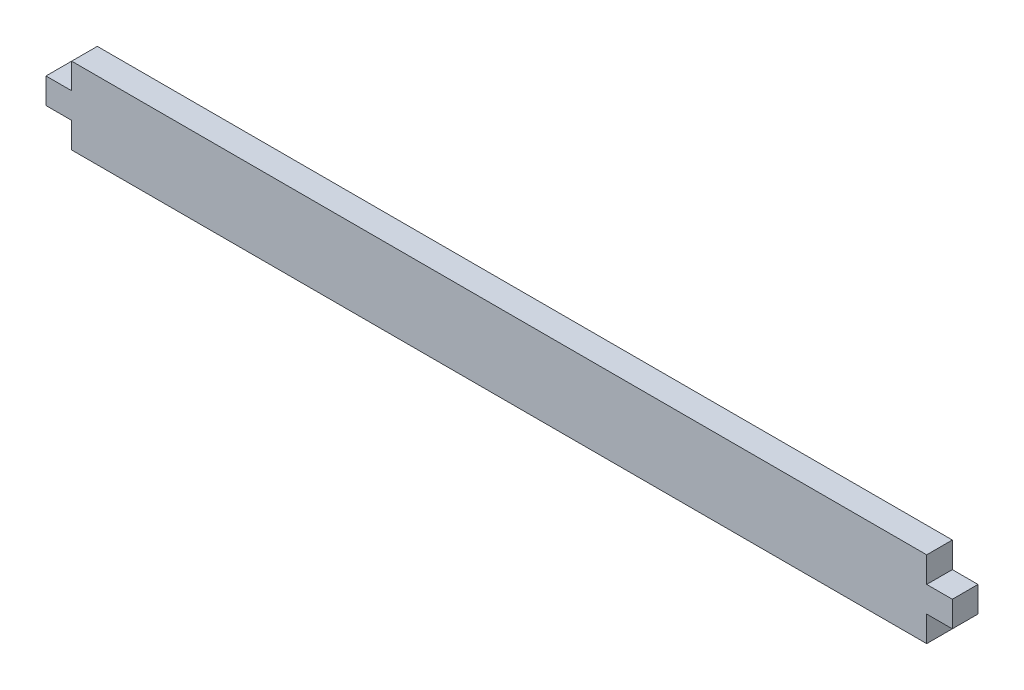
ISO-10303-21;
HEADER;
FILE_DESCRIPTION(('STEP AP214'),'2;1');
FILE_NAME('part.step','',(''),(''),'','','');
FILE_SCHEMA(('AUTOMOTIVE_DESIGN { 1 0 10303 214 1 1 1 1 }'));
ENDSEC;
DATA;
#1=APPLICATION_CONTEXT('core data for automotive mechanical design processes');
#2=APPLICATION_PROTOCOL_DEFINITION('international standard','automotive_design',2000,#1);
#3=PRODUCT_CONTEXT('',#1,'mechanical');
#4=PRODUCT('Part','Part','',(#3));
#5=PRODUCT_RELATED_PRODUCT_CATEGORY('part','',(#4));
#6=PRODUCT_DEFINITION_FORMATION('','',#4);
#7=PRODUCT_DEFINITION_CONTEXT('part definition',#1,'design');
#8=PRODUCT_DEFINITION('design','',#6,#7);
#9=PRODUCT_DEFINITION_SHAPE('','',#8);
#10=(LENGTH_UNIT() NAMED_UNIT(*) SI_UNIT(.MILLI.,.METRE.));
#11=(NAMED_UNIT(*) PLANE_ANGLE_UNIT() SI_UNIT($,.RADIAN.));
#12=(NAMED_UNIT(*) SI_UNIT($,.STERADIAN.) SOLID_ANGLE_UNIT());
#13=UNCERTAINTY_MEASURE_WITH_UNIT(LENGTH_MEASURE(1.E-05),#10,'distance_accuracy_value','');
#14=(GEOMETRIC_REPRESENTATION_CONTEXT(3) GLOBAL_UNCERTAINTY_ASSIGNED_CONTEXT((#13)) GLOBAL_UNIT_ASSIGNED_CONTEXT((#10,
#11,#12)) REPRESENTATION_CONTEXT('',''));
#15=CARTESIAN_POINT('',(0.,0.,0.));
#16=DIRECTION('',(0.,0.,1.));
#17=DIRECTION('',(1.,0.,0.));
#18=AXIS2_PLACEMENT_3D('',#15,#16,#17);
#19=CARTESIAN_POINT('',(0.,0.,3.));
#20=DIRECTION('',(1.,0.,0.));
#21=DIRECTION('',(0.,1.,0.));
#22=AXIS2_PLACEMENT_3D('',#19,#20,#21);
#23=PLANE('',#22);
#24=DIRECTION('',(0.,-1.,0.));
#25=VECTOR('',#24,1.);
#26=CARTESIAN_POINT('',(0.,0.,0.));
#27=LINE('',#26,#25);
#28=CARTESIAN_POINT('',(0.,3.,0.));
#29=VERTEX_POINT('',#28);
#30=CARTESIAN_POINT('',(0.,0.,0.));
#31=VERTEX_POINT('',#30);
#32=EDGE_CURVE('E153',#29,#31,#27,.T.);
#33=ORIENTED_EDGE('',*,*,#32,.T.);
#34=DIRECTION('',(0.,0.,-1.));
#35=VECTOR('',#34,1.);
#36=CARTESIAN_POINT('',(0.,0.,3.));
#37=LINE('',#36,#35);
#38=CARTESIAN_POINT('',(0.,0.,3.));
#39=VERTEX_POINT('',#38);
#40=EDGE_CURVE('E11',#39,#31,#37,.T.);
#41=ORIENTED_EDGE('',*,*,#40,.F.);
#42=DIRECTION('',(0.,-1.,0.));
#43=VECTOR('',#42,1.);
#44=CARTESIAN_POINT('',(0.,0.,3.));
#45=LINE('',#44,#43);
#46=CARTESIAN_POINT('',(0.,3.,3.));
#47=VERTEX_POINT('',#46);
#48=EDGE_CURVE('E175',#47,#39,#45,.T.);
#49=ORIENTED_EDGE('',*,*,#48,.F.);
#50=DIRECTION('',(0.,0.,-1.));
#51=VECTOR('',#50,1.);
#52=CARTESIAN_POINT('',(0.,3.,3.));
#53=LINE('',#52,#51);
#54=EDGE_CURVE('E149',#47,#29,#53,.T.);
#55=ORIENTED_EDGE('',*,*,#54,.T.);
#56=EDGE_LOOP('',(#33,#41,#49,#55));
#57=FACE_BOUND('',#56,.T.);
#58=ADVANCED_FACE('F33',(#57),#23,.F.);
#59=CARTESIAN_POINT('',(0.,0.,3.));
#60=DIRECTION('',(0.,1.,0.));
#61=DIRECTION('',(0.,0.,1.));
#62=AXIS2_PLACEMENT_3D('',#59,#60,#61);
#63=PLANE('',#62);
#64=DIRECTION('',(1.,0.,0.));
#65=VECTOR('',#64,1.);
#66=CARTESIAN_POINT('',(0.,0.,0.));
#67=LINE('',#66,#65);
#68=CARTESIAN_POINT('',(100.,0.,0.));
#69=VERTEX_POINT('',#68);
#70=EDGE_CURVE('E156',#31,#69,#67,.T.);
#71=ORIENTED_EDGE('',*,*,#70,.T.);
#72=DIRECTION('',(0.,0.,-1.));
#73=VECTOR('',#72,1.);
#74=CARTESIAN_POINT('',(100.,0.,3.));
#75=LINE('',#74,#73);
#76=CARTESIAN_POINT('',(100.,0.,3.));
#77=VERTEX_POINT('',#76);
#78=EDGE_CURVE('E41',#77,#69,#75,.T.);
#79=ORIENTED_EDGE('',*,*,#78,.F.);
#80=DIRECTION('',(1.,0.,0.));
#81=VECTOR('',#80,1.);
#82=CARTESIAN_POINT('',(0.,0.,3.));
#83=LINE('',#82,#81);
#84=EDGE_CURVE('E104',#39,#77,#83,.T.);
#85=ORIENTED_EDGE('',*,*,#84,.F.);
#86=ORIENTED_EDGE('',*,*,#40,.T.);
#87=EDGE_LOOP('',(#71,#79,#85,#86));
#88=FACE_BOUND('',#87,.T.);
#89=ADVANCED_FACE('F253',(#88),#63,.F.);
#90=CARTESIAN_POINT('',(100.,0.,3.));
#91=DIRECTION('',(-1.,0.,0.));
#92=DIRECTION('',(0.,0.,1.));
#93=AXIS2_PLACEMENT_3D('',#90,#91,#92);
#94=PLANE('',#93);
#95=DIRECTION('',(0.,1.,0.));
#96=VECTOR('',#95,1.);
#97=CARTESIAN_POINT('',(100.,0.,0.));
#98=LINE('',#97,#96);
#99=CARTESIAN_POINT('',(100.,3.00000000000001,0.));
#100=VERTEX_POINT('',#99);
#101=EDGE_CURVE('E158',#69,#100,#98,.T.);
#102=ORIENTED_EDGE('',*,*,#101,.T.);
#103=DIRECTION('',(0.,0.,-1.));
#104=VECTOR('',#103,1.);
#105=CARTESIAN_POINT('',(100.,3.00000000000001,3.));
#106=LINE('',#105,#104);
#107=CARTESIAN_POINT('',(100.,3.00000000000001,3.));
#108=VERTEX_POINT('',#107);
#109=EDGE_CURVE('E194',#108,#100,#106,.T.);
#110=ORIENTED_EDGE('',*,*,#109,.F.);
#111=DIRECTION('',(0.,1.,0.));
#112=VECTOR('',#111,1.);
#113=CARTESIAN_POINT('',(100.,0.,3.));
#114=LINE('',#113,#112);
#115=EDGE_CURVE('E202',#77,#108,#114,.T.);
#116=ORIENTED_EDGE('',*,*,#115,.F.);
#117=ORIENTED_EDGE('',*,*,#78,.T.);
#118=EDGE_LOOP('',(#102,#110,#116,#117));
#119=FACE_BOUND('',#118,.T.);
#120=ADVANCED_FACE('F200',(#119),#94,.F.);
#121=CARTESIAN_POINT('',(100.,3.00000000000001,3.));
#122=DIRECTION('',(0.,1.,0.));
#123=DIRECTION('',(-1.,0.,0.));
#124=AXIS2_PLACEMENT_3D('',#121,#122,#123);
#125=PLANE('',#124);
#126=DIRECTION('',(1.,0.,0.));
#127=VECTOR('',#126,1.);
#128=CARTESIAN_POINT('',(100.,3.00000000000001,0.));
#129=LINE('',#128,#127);
#130=CARTESIAN_POINT('',(103.,3.00000000000001,0.));
#131=VERTEX_POINT('',#130);
#132=EDGE_CURVE('E160',#100,#131,#129,.T.);
#133=ORIENTED_EDGE('',*,*,#132,.T.);
#134=DIRECTION('',(0.,0.,-1.));
#135=VECTOR('',#134,1.);
#136=CARTESIAN_POINT('',(103.,3.00000000000001,3.));
#137=LINE('',#136,#135);
#138=CARTESIAN_POINT('',(103.,3.00000000000001,3.));
#139=VERTEX_POINT('',#138);
#140=EDGE_CURVE('E191',#139,#131,#137,.T.);
#141=ORIENTED_EDGE('',*,*,#140,.F.);
#142=DIRECTION('',(1.,0.,0.));
#143=VECTOR('',#142,1.);
#144=CARTESIAN_POINT('',(100.,3.00000000000001,3.));
#145=LINE('',#144,#143);
#146=EDGE_CURVE('E220',#108,#139,#145,.T.);
#147=ORIENTED_EDGE('',*,*,#146,.F.);
#148=ORIENTED_EDGE('',*,*,#109,.T.);
#149=EDGE_LOOP('',(#133,#141,#147,#148));
#150=FACE_BOUND('',#149,.T.);
#151=ADVANCED_FACE('F211',(#150),#125,.F.);
#152=CARTESIAN_POINT('',(103.,6.00000000000002,3.));
#153=DIRECTION('',(-1.,0.,0.));
#154=DIRECTION('',(0.,0.,1.));
#155=AXIS2_PLACEMENT_3D('',#152,#153,#154);
#156=PLANE('',#155);
#157=DIRECTION('',(0.,1.,0.));
#158=VECTOR('',#157,1.);
#159=CARTESIAN_POINT('',(103.,6.00000000000002,0.));
#160=LINE('',#159,#158);
#161=CARTESIAN_POINT('',(103.,6.00000000000002,0.));
#162=VERTEX_POINT('',#161);
#163=EDGE_CURVE('E162',#131,#162,#160,.T.);
#164=ORIENTED_EDGE('',*,*,#163,.T.);
#165=DIRECTION('',(0.,0.,-1.));
#166=VECTOR('',#165,1.);
#167=CARTESIAN_POINT('',(103.,6.00000000000002,3.));
#168=LINE('',#167,#166);
#169=CARTESIAN_POINT('',(103.,6.00000000000002,3.));
#170=VERTEX_POINT('',#169);
#171=EDGE_CURVE('E188',#170,#162,#168,.T.);
#172=ORIENTED_EDGE('',*,*,#171,.F.);
#173=DIRECTION('',(0.,1.,0.));
#174=VECTOR('',#173,1.);
#175=CARTESIAN_POINT('',(103.,6.00000000000002,3.));
#176=LINE('',#175,#174);
#177=EDGE_CURVE('E217',#139,#170,#176,.T.);
#178=ORIENTED_EDGE('',*,*,#177,.F.);
#179=ORIENTED_EDGE('',*,*,#140,.T.);
#180=EDGE_LOOP('',(#164,#172,#178,#179));
#181=FACE_BOUND('',#180,.T.);
#182=ADVANCED_FACE('F215',(#181),#156,.F.);
#183=CARTESIAN_POINT('',(100.,6.00000000000002,3.));
#184=DIRECTION('',(0.,-1.,0.));
#185=DIRECTION('',(0.,0.,-1.));
#186=AXIS2_PLACEMENT_3D('',#183,#184,#185);
#187=PLANE('',#186);
#188=DIRECTION('',(-1.,0.,0.));
#189=VECTOR('',#188,1.);
#190=CARTESIAN_POINT('',(100.,6.00000000000002,0.));
#191=LINE('',#190,#189);
#192=CARTESIAN_POINT('',(100.,6.00000000000002,0.));
#193=VERTEX_POINT('',#192);
#194=EDGE_CURVE('E164',#162,#193,#191,.T.);
#195=ORIENTED_EDGE('',*,*,#194,.T.);
#196=DIRECTION('',(0.,0.,-1.));
#197=VECTOR('',#196,1.);
#198=CARTESIAN_POINT('',(100.,6.00000000000002,3.));
#199=LINE('',#198,#197);
#200=CARTESIAN_POINT('',(100.,6.00000000000002,3.));
#201=VERTEX_POINT('',#200);
#202=EDGE_CURVE('E185',#201,#193,#199,.T.);
#203=ORIENTED_EDGE('',*,*,#202,.F.);
#204=DIRECTION('',(-1.,0.,0.));
#205=VECTOR('',#204,1.);
#206=CARTESIAN_POINT('',(100.,6.00000000000002,3.));
#207=LINE('',#206,#205);
#208=EDGE_CURVE('E219',#170,#201,#207,.T.);
#209=ORIENTED_EDGE('',*,*,#208,.F.);
#210=ORIENTED_EDGE('',*,*,#171,.T.);
#211=EDGE_LOOP('',(#195,#203,#209,#210));
#212=FACE_BOUND('',#211,.T.);
#213=ADVANCED_FACE('F266',(#212),#187,.F.);
#214=CARTESIAN_POINT('',(100.,6.00000000000002,3.));
#215=DIRECTION('',(-1.,0.,0.));
#216=DIRECTION('',(0.,0.,1.));
#217=AXIS2_PLACEMENT_3D('',#214,#215,#216);
#218=PLANE('',#217);
#219=DIRECTION('',(0.,1.,0.));
#220=VECTOR('',#219,1.);
#221=CARTESIAN_POINT('',(100.,6.00000000000002,0.));
#222=LINE('',#221,#220);
#223=CARTESIAN_POINT('',(100.,9.00000000000001,0.));
#224=VERTEX_POINT('',#223);
#225=EDGE_CURVE('E166',#193,#224,#222,.T.);
#226=ORIENTED_EDGE('',*,*,#225,.T.);
#227=DIRECTION('',(0.,0.,-1.));
#228=VECTOR('',#227,1.);
#229=CARTESIAN_POINT('',(100.,9.00000000000001,3.));
#230=LINE('',#229,#228);
#231=CARTESIAN_POINT('',(100.,9.00000000000001,3.));
#232=VERTEX_POINT('',#231);
#233=EDGE_CURVE('E182',#232,#224,#230,.T.);
#234=ORIENTED_EDGE('',*,*,#233,.F.);
#235=DIRECTION('',(0.,1.,0.));
#236=VECTOR('',#235,1.);
#237=CARTESIAN_POINT('',(100.,6.00000000000002,3.));
#238=LINE('',#237,#236);
#239=EDGE_CURVE('E222',#201,#232,#238,.T.);
#240=ORIENTED_EDGE('',*,*,#239,.F.);
#241=ORIENTED_EDGE('',*,*,#202,.T.);
#242=EDGE_LOOP('',(#226,#234,#240,#241));
#243=FACE_BOUND('',#242,.T.);
#244=ADVANCED_FACE('F269',(#243),#218,.F.);
#245=CARTESIAN_POINT('',(0.,9.,3.));
#246=DIRECTION('',(0.,-1.,0.));
#247=DIRECTION('',(1.,0.,0.));
#248=AXIS2_PLACEMENT_3D('',#245,#246,#247);
#249=PLANE('',#248);
#250=DIRECTION('',(-1.,0.,0.));
#251=VECTOR('',#250,1.);
#252=CARTESIAN_POINT('',(0.,9.,0.));
#253=LINE('',#252,#251);
#254=CARTESIAN_POINT('',(0.,9.,0.));
#255=VERTEX_POINT('',#254);
#256=EDGE_CURVE('E168',#224,#255,#253,.T.);
#257=ORIENTED_EDGE('',*,*,#256,.T.);
#258=DIRECTION('',(0.,0.,-1.));
#259=VECTOR('',#258,1.);
#260=CARTESIAN_POINT('',(0.,9.,3.));
#261=LINE('',#260,#259);
#262=CARTESIAN_POINT('',(0.,9.,3.));
#263=VERTEX_POINT('',#262);
#264=EDGE_CURVE('E179',#263,#255,#261,.T.);
#265=ORIENTED_EDGE('',*,*,#264,.F.);
#266=DIRECTION('',(-1.,0.,0.));
#267=VECTOR('',#266,1.);
#268=CARTESIAN_POINT('',(0.,9.,3.));
#269=LINE('',#268,#267);
#270=EDGE_CURVE('E228',#232,#263,#269,.T.);
#271=ORIENTED_EDGE('',*,*,#270,.F.);
#272=ORIENTED_EDGE('',*,*,#233,.T.);
#273=EDGE_LOOP('',(#257,#265,#271,#272));
#274=FACE_BOUND('',#273,.T.);
#275=ADVANCED_FACE('F234',(#274),#249,.F.);
#276=CARTESIAN_POINT('',(0.,6.,3.));
#277=DIRECTION('',(1.,0.,0.));
#278=DIRECTION('',(0.,0.,-1.));
#279=AXIS2_PLACEMENT_3D('',#276,#277,#278);
#280=PLANE('',#279);
#281=DIRECTION('',(0.,-1.,0.));
#282=VECTOR('',#281,1.);
#283=CARTESIAN_POINT('',(0.,6.,0.));
#284=LINE('',#283,#282);
#285=CARTESIAN_POINT('',(0.,6.,0.));
#286=VERTEX_POINT('',#285);
#287=EDGE_CURVE('E170',#255,#286,#284,.T.);
#288=ORIENTED_EDGE('',*,*,#287,.T.);
#289=DIRECTION('',(0.,0.,-1.));
#290=VECTOR('',#289,1.);
#291=CARTESIAN_POINT('',(0.,6.,3.));
#292=LINE('',#291,#290);
#293=CARTESIAN_POINT('',(0.,6.,3.));
#294=VERTEX_POINT('',#293);
#295=EDGE_CURVE('E144',#294,#286,#292,.T.);
#296=ORIENTED_EDGE('',*,*,#295,.F.);
#297=DIRECTION('',(0.,-1.,0.));
#298=VECTOR('',#297,1.);
#299=CARTESIAN_POINT('',(0.,6.,3.));
#300=LINE('',#299,#298);
#301=EDGE_CURVE('E135',#263,#294,#300,.T.);
#302=ORIENTED_EDGE('',*,*,#301,.F.);
#303=ORIENTED_EDGE('',*,*,#264,.T.);
#304=EDGE_LOOP('',(#288,#296,#302,#303));
#305=FACE_BOUND('',#304,.T.);
#306=ADVANCED_FACE('F238',(#305),#280,.F.);
#307=CARTESIAN_POINT('',(0.,6.,3.));
#308=DIRECTION('',(0.,-1.,0.));
#309=DIRECTION('',(0.,0.,-1.));
#310=AXIS2_PLACEMENT_3D('',#307,#308,#309);
#311=PLANE('',#310);
#312=DIRECTION('',(-1.,0.,0.));
#313=VECTOR('',#312,1.);
#314=CARTESIAN_POINT('',(0.,6.,0.));
#315=LINE('',#314,#313);
#316=CARTESIAN_POINT('',(-3.,6.,0.));
#317=VERTEX_POINT('',#316);
#318=EDGE_CURVE('E143',#286,#317,#315,.T.);
#319=ORIENTED_EDGE('',*,*,#318,.T.);
#320=DIRECTION('',(0.,0.,-1.));
#321=VECTOR('',#320,1.);
#322=CARTESIAN_POINT('',(-3.,6.,3.));
#323=LINE('',#322,#321);
#324=CARTESIAN_POINT('',(-3.,6.,3.));
#325=VERTEX_POINT('',#324);
#326=EDGE_CURVE('E140',#325,#317,#323,.T.);
#327=ORIENTED_EDGE('',*,*,#326,.F.);
#328=DIRECTION('',(-1.,0.,0.));
#329=VECTOR('',#328,1.);
#330=CARTESIAN_POINT('',(0.,6.,3.));
#331=LINE('',#330,#329);
#332=EDGE_CURVE('E129',#294,#325,#331,.T.);
#333=ORIENTED_EDGE('',*,*,#332,.F.);
#334=ORIENTED_EDGE('',*,*,#295,.T.);
#335=EDGE_LOOP('',(#319,#327,#333,#334));
#336=FACE_BOUND('',#335,.T.);
#337=ADVANCED_FACE('F141',(#336),#311,.F.);
#338=CARTESIAN_POINT('',(-3.,6.,3.));
#339=DIRECTION('',(1.,0.,0.));
#340=DIRECTION('',(0.,1.,0.));
#341=AXIS2_PLACEMENT_3D('',#338,#339,#340);
#342=PLANE('',#341);
#343=DIRECTION('',(0.,-1.,0.));
#344=VECTOR('',#343,1.);
#345=CARTESIAN_POINT('',(-3.,6.,0.));
#346=LINE('',#345,#344);
#347=CARTESIAN_POINT('',(-3.,3.,0.));
#348=VERTEX_POINT('',#347);
#349=EDGE_CURVE('E90',#317,#348,#346,.T.);
#350=ORIENTED_EDGE('',*,*,#349,.T.);
#351=DIRECTION('',(0.,0.,-1.));
#352=VECTOR('',#351,1.);
#353=CARTESIAN_POINT('',(-3.,3.,3.));
#354=LINE('',#353,#352);
#355=CARTESIAN_POINT('',(-3.,3.,3.));
#356=VERTEX_POINT('',#355);
#357=EDGE_CURVE('E145',#356,#348,#354,.T.);
#358=ORIENTED_EDGE('',*,*,#357,.F.);
#359=DIRECTION('',(0.,-1.,0.));
#360=VECTOR('',#359,1.);
#361=CARTESIAN_POINT('',(-3.,6.,3.));
#362=LINE('',#361,#360);
#363=EDGE_CURVE('E133',#325,#356,#362,.T.);
#364=ORIENTED_EDGE('',*,*,#363,.F.);
#365=ORIENTED_EDGE('',*,*,#326,.T.);
#366=EDGE_LOOP('',(#350,#358,#364,#365));
#367=FACE_BOUND('',#366,.T.);
#368=ADVANCED_FACE('F147',(#367),#342,.F.);
#369=CARTESIAN_POINT('',(0.,3.,3.));
#370=DIRECTION('',(0.,1.,0.));
#371=DIRECTION('',(0.,0.,1.));
#372=AXIS2_PLACEMENT_3D('',#369,#370,#371);
#373=PLANE('',#372);
#374=DIRECTION('',(1.,0.,0.));
#375=VECTOR('',#374,1.);
#376=CARTESIAN_POINT('',(0.,3.,0.));
#377=LINE('',#376,#375);
#378=EDGE_CURVE('E96',#348,#29,#377,.T.);
#379=ORIENTED_EDGE('',*,*,#378,.T.);
#380=ORIENTED_EDGE('',*,*,#54,.F.);
#381=DIRECTION('',(1.,0.,0.));
#382=VECTOR('',#381,1.);
#383=CARTESIAN_POINT('',(0.,3.,3.));
#384=LINE('',#383,#382);
#385=EDGE_CURVE('E49',#356,#47,#384,.T.);
#386=ORIENTED_EDGE('',*,*,#385,.F.);
#387=ORIENTED_EDGE('',*,*,#357,.T.);
#388=EDGE_LOOP('',(#379,#380,#386,#387));
#389=FACE_BOUND('',#388,.T.);
#390=ADVANCED_FACE('F242',(#389),#373,.F.);
#391=CARTESIAN_POINT('',(0.,0.,3.));
#392=DIRECTION('',(0.,0.,1.));
#393=DIRECTION('',(1.,0.,0.));
#394=AXIS2_PLACEMENT_3D('',#391,#392,#393);
#395=PLANE('',#394);
#396=ORIENTED_EDGE('',*,*,#48,.T.);
#397=ORIENTED_EDGE('',*,*,#84,.T.);
#398=ORIENTED_EDGE('',*,*,#115,.T.);
#399=ORIENTED_EDGE('',*,*,#146,.T.);
#400=ORIENTED_EDGE('',*,*,#177,.T.);
#401=ORIENTED_EDGE('',*,*,#208,.T.);
#402=ORIENTED_EDGE('',*,*,#239,.T.);
#403=ORIENTED_EDGE('',*,*,#270,.T.);
#404=ORIENTED_EDGE('',*,*,#301,.T.);
#405=ORIENTED_EDGE('',*,*,#332,.T.);
#406=ORIENTED_EDGE('',*,*,#363,.T.);
#407=ORIENTED_EDGE('',*,*,#385,.T.);
#408=EDGE_LOOP('',(#396,#397,#398,#399,#400,#401,#402,#403,#404,#405,#406,#407));
#409=FACE_BOUND('',#408,.T.);
#410=ADVANCED_FACE('F131',(#409),#395,.T.);
#411=CARTESIAN_POINT('',(0.,0.,0.));
#412=DIRECTION('',(0.,0.,1.));
#413=DIRECTION('',(1.,0.,0.));
#414=AXIS2_PLACEMENT_3D('',#411,#412,#413);
#415=PLANE('',#414);
#416=ORIENTED_EDGE('',*,*,#32,.F.);
#417=ORIENTED_EDGE('',*,*,#378,.F.);
#418=ORIENTED_EDGE('',*,*,#349,.F.);
#419=ORIENTED_EDGE('',*,*,#318,.F.);
#420=ORIENTED_EDGE('',*,*,#287,.F.);
#421=ORIENTED_EDGE('',*,*,#256,.F.);
#422=ORIENTED_EDGE('',*,*,#225,.F.);
#423=ORIENTED_EDGE('',*,*,#194,.F.);
#424=ORIENTED_EDGE('',*,*,#163,.F.);
#425=ORIENTED_EDGE('',*,*,#132,.F.);
#426=ORIENTED_EDGE('',*,*,#101,.F.);
#427=ORIENTED_EDGE('',*,*,#70,.F.);
#428=EDGE_LOOP('',(#416,#417,#418,#419,#420,#421,#422,#423,#424,#425,#426,#427));
#429=FACE_BOUND('',#428,.T.);
#430=ADVANCED_FACE('F206',(#429),#415,.F.);
#431=CLOSED_SHELL('',(#58,#89,#120,#151,#182,#213,#244,#275,#306,#337,#368,#390,#410,#430));
#432=MANIFOLD_SOLID_BREP('B2',#431);
#433=ADVANCED_BREP_SHAPE_REPRESENTATION('',(#18,#432),#14);
#434=SHAPE_DEFINITION_REPRESENTATION(#9,#433);
ENDSEC;
END-ISO-10303-21;
